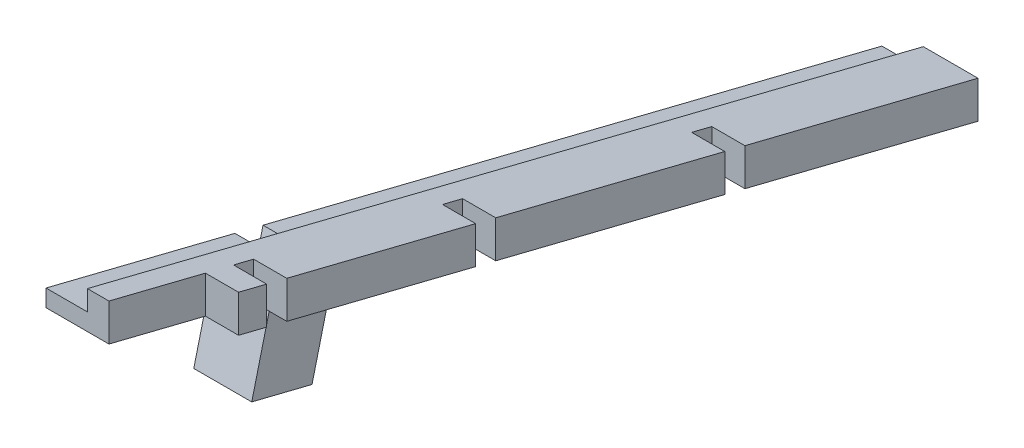
ISO-10303-21;
HEADER;
FILE_DESCRIPTION(('STEP AP214'),'2;1');
FILE_NAME('part.step','',(''),(''),'','','');
FILE_SCHEMA(('AUTOMOTIVE_DESIGN { 1 0 10303 214 1 1 1 1 }'));
ENDSEC;
DATA;
#1=APPLICATION_CONTEXT('core data for automotive mechanical design processes');
#2=APPLICATION_PROTOCOL_DEFINITION('international standard','automotive_design',2000,#1);
#3=PRODUCT_CONTEXT('',#1,'mechanical');
#4=PRODUCT('Part','Part','',(#3));
#5=PRODUCT_RELATED_PRODUCT_CATEGORY('part','',(#4));
#6=PRODUCT_DEFINITION_FORMATION('','',#4);
#7=PRODUCT_DEFINITION_CONTEXT('part definition',#1,'design');
#8=PRODUCT_DEFINITION('design','',#6,#7);
#9=PRODUCT_DEFINITION_SHAPE('','',#8);
#10=(LENGTH_UNIT() NAMED_UNIT(*) SI_UNIT(.MILLI.,.METRE.));
#11=(NAMED_UNIT(*) PLANE_ANGLE_UNIT() SI_UNIT($,.RADIAN.));
#12=(NAMED_UNIT(*) SI_UNIT($,.STERADIAN.) SOLID_ANGLE_UNIT());
#13=UNCERTAINTY_MEASURE_WITH_UNIT(LENGTH_MEASURE(1.E-05),#10,'distance_accuracy_value','');
#14=(GEOMETRIC_REPRESENTATION_CONTEXT(3) GLOBAL_UNCERTAINTY_ASSIGNED_CONTEXT((#13)) GLOBAL_UNIT_ASSIGNED_CONTEXT((#10,
#11,#12)) REPRESENTATION_CONTEXT('',''));
#15=CARTESIAN_POINT('',(0.,0.,0.));
#16=DIRECTION('',(0.,0.,1.));
#17=DIRECTION('',(1.,0.,0.));
#18=AXIS2_PLACEMENT_3D('',#15,#16,#17);
#19=CARTESIAN_POINT('',(4.,-4.23663208393258,1.05631101626826));
#20=DIRECTION('',(0.,0.970295726275996,-0.241921895599668));
#21=DIRECTION('',(0.,0.241921895599668,0.970295726275996));
#22=AXIS2_PLACEMENT_3D('',#19,#20,#21);
#23=PLANE('',#22);
#24=DIRECTION('',(1.,0.,0.));
#25=VECTOR('',#24,1.);
#26=CARTESIAN_POINT('',(-7.6,-8.49203641904656,-16.0111835554926));
#27=LINE('',#26,#25);
#28=CARTESIAN_POINT('',(-7.6,-8.49203641904656,-16.0111835554926));
#29=VERTEX_POINT('',#28);
#30=CARTESIAN_POINT('',(-0.6,-8.49203641904656,-16.0111835554926));
#31=VERTEX_POINT('',#30);
#32=EDGE_CURVE('E263',#29,#31,#27,.T.);
#33=ORIENTED_EDGE('',*,*,#32,.F.);
#34=DIRECTION('',(0.,0.241921895599668,0.970295726275996));
#35=VECTOR('',#34,1.);
#36=CARTESIAN_POINT('',(-7.6,-26.7568143951695,-89.2672068173917));
#37=LINE('',#36,#35);
#38=CARTESIAN_POINT('',(-7.6,-26.7568143951695,-89.2672068173917));
#39=VERTEX_POINT('',#38);
#40=EDGE_CURVE('E232',#39,#29,#37,.T.);
#41=ORIENTED_EDGE('',*,*,#40,.F.);
#42=DIRECTION('',(1.,0.,0.));
#43=VECTOR('',#42,1.);
#44=CARTESIAN_POINT('',(-2.6,-26.7568143951695,-89.2672068173917));
#45=LINE('',#44,#43);
#46=CARTESIAN_POINT('',(4.,-26.7568143951695,-89.2672068173917));
#47=VERTEX_POINT('',#46);
#48=EDGE_CURVE('E465',#39,#47,#45,.T.);
#49=ORIENTED_EDGE('',*,*,#48,.T.);
#50=DIRECTION('',(0.,-0.241921895599668,-0.970295726275996));
#51=VECTOR('',#50,1.);
#52=CARTESIAN_POINT('',(4.,-4.23663208393258,1.05631101626826));
#53=LINE('',#52,#51);
#54=CARTESIAN_POINT('',(4.,-19.7410794227791,-61.1286307553878));
#55=VERTEX_POINT('',#54);
#56=EDGE_CURVE('E341',#55,#47,#53,.T.);
#57=ORIENTED_EDGE('',*,*,#56,.F.);
#58=DIRECTION('',(-1.,0.,0.));
#59=VECTOR('',#58,1.);
#60=CARTESIAN_POINT('',(4.,-19.7410794227791,-61.1286307553878));
#61=LINE('',#60,#59);
#62=CARTESIAN_POINT('',(0.,-19.7410794227791,-61.1286307553878));
#63=VERTEX_POINT('',#62);
#64=EDGE_CURVE('E359',#55,#63,#61,.T.);
#65=ORIENTED_EDGE('',*,*,#64,.T.);
#66=DIRECTION('',(0.,0.241921895599668,0.970295726275996));
#67=VECTOR('',#66,1.);
#68=CARTESIAN_POINT('',(0.,-26.7568143951695,-89.2672068173917));
#69=LINE('',#68,#67);
#70=CARTESIAN_POINT('',(0.,-19.1362746837799,-58.7028914396978));
#71=VERTEX_POINT('',#70);
#72=EDGE_CURVE('E452',#63,#71,#69,.T.);
#73=ORIENTED_EDGE('',*,*,#72,.T.);
#74=DIRECTION('',(-1.,0.,0.));
#75=VECTOR('',#74,1.);
#76=CARTESIAN_POINT('',(4.,-19.1362746837799,-58.7028914396978));
#77=LINE('',#76,#75);
#78=CARTESIAN_POINT('',(4.,-19.1362746837799,-58.7028914396978));
#79=VERTEX_POINT('',#78);
#80=EDGE_CURVE('E390',#79,#71,#77,.T.);
#81=ORIENTED_EDGE('',*,*,#80,.F.);
#82=DIRECTION('',(0.,-0.241921895599668,-0.970295726275996));
#83=VECTOR('',#82,1.);
#84=CARTESIAN_POINT('',(4.,-4.23663208393258,1.05631101626826));
#85=LINE('',#84,#83);
#86=CARTESIAN_POINT('',(4.,-12.2415006591894,-31.0494632408319));
#87=VERTEX_POINT('',#86);
#88=EDGE_CURVE('E367',#87,#79,#85,.T.);
#89=ORIENTED_EDGE('',*,*,#88,.F.);
#90=DIRECTION('',(-1.,0.,0.));
#91=VECTOR('',#90,1.);
#92=CARTESIAN_POINT('',(4.,-12.2415006591894,-31.0494632408319));
#93=LINE('',#92,#91);
#94=CARTESIAN_POINT('',(0.,-12.2415006591894,-31.0494632408319));
#95=VERTEX_POINT('',#94);
#96=EDGE_CURVE('E394',#87,#95,#93,.T.);
#97=ORIENTED_EDGE('',*,*,#96,.T.);
#98=CARTESIAN_POINT('',(0.,-11.6366959201902,-28.6237239251419));
#99=VERTEX_POINT('',#98);
#100=EDGE_CURVE('E455',#95,#99,#69,.T.);
#101=ORIENTED_EDGE('',*,*,#100,.T.);
#102=DIRECTION('',(-1.,0.,0.));
#103=VECTOR('',#102,1.);
#104=CARTESIAN_POINT('',(4.,-11.6366959201902,-28.6237239251419));
#105=LINE('',#104,#103);
#106=CARTESIAN_POINT('',(4.,-11.6366959201902,-28.6237239251419));
#107=VERTEX_POINT('',#106);
#108=EDGE_CURVE('E425',#107,#99,#105,.T.);
#109=ORIENTED_EDGE('',*,*,#108,.F.);
#110=DIRECTION('',(0.,-0.241921895599668,-0.970295726275996));
#111=VECTOR('',#110,1.);
#112=CARTESIAN_POINT('',(4.,-4.23663208393258,1.05631101626826));
#113=LINE('',#112,#111);
#114=CARTESIAN_POINT('',(4.,-5.95153137359801,-5.82177435765599));
#115=VERTEX_POINT('',#114);
#116=EDGE_CURVE('E402',#115,#107,#113,.T.);
#117=ORIENTED_EDGE('',*,*,#116,.F.);
#118=DIRECTION('',(-1.,0.,0.));
#119=VECTOR('',#118,1.);
#120=CARTESIAN_POINT('',(4.,-5.95153137359801,-5.82177435765599));
#121=LINE('',#120,#119);
#122=CARTESIAN_POINT('',(0.,-5.95153137359801,-5.82177435765599));
#123=VERTEX_POINT('',#122);
#124=EDGE_CURVE('E429',#115,#123,#121,.T.);
#125=ORIENTED_EDGE('',*,*,#124,.T.);
#126=CARTESIAN_POINT('',(0.,-5.34672663459884,-3.39603504196599));
#127=VERTEX_POINT('',#126);
#128=EDGE_CURVE('E514',#123,#127,#69,.T.);
#129=ORIENTED_EDGE('',*,*,#128,.T.);
#130=DIRECTION('',(-1.,0.,0.));
#131=VECTOR('',#130,1.);
#132=CARTESIAN_POINT('',(4.,-5.34672663459884,-3.39603504196599));
#133=LINE('',#132,#131);
#134=CARTESIAN_POINT('',(4.,-5.34672663459884,-3.39603504196599));
#135=VERTEX_POINT('',#134);
#136=EDGE_CURVE('E11',#135,#127,#133,.T.);
#137=ORIENTED_EDGE('',*,*,#136,.F.);
#138=DIRECTION('',(0.,-0.241921895599668,-0.970295726275996));
#139=VECTOR('',#138,1.);
#140=CARTESIAN_POINT('',(4.,-4.23663208393258,1.05631101626826));
#141=LINE('',#140,#139);
#142=CARTESIAN_POINT('',(4.,-4.5,0.));
#143=VERTEX_POINT('',#142);
#144=EDGE_CURVE('E472',#143,#135,#141,.T.);
#145=ORIENTED_EDGE('',*,*,#144,.F.);
#146=DIRECTION('',(-1.,0.,0.));
#147=VECTOR('',#146,1.);
#148=CARTESIAN_POINT('',(4.,-4.5,0.));
#149=LINE('',#148,#147);
#150=CARTESIAN_POINT('',(0.,-4.5,0.));
#151=VERTEX_POINT('',#150);
#152=EDGE_CURVE('E487',#143,#151,#149,.T.);
#153=ORIENTED_EDGE('',*,*,#152,.T.);
#154=CARTESIAN_POINT('',(0.,-1.59693725280398,11.643548715312));
#155=VERTEX_POINT('',#154);
#156=EDGE_CURVE('E450',#151,#155,#69,.T.);
#157=ORIENTED_EDGE('',*,*,#156,.T.);
#158=DIRECTION('',(1.,0.,0.));
#159=VECTOR('',#158,1.);
#160=CARTESIAN_POINT('',(-2.6,-1.59693725280398,11.643548715312));
#161=LINE('',#160,#159);
#162=CARTESIAN_POINT('',(-7.6,-1.59693725280398,11.643548715312));
#163=VERTEX_POINT('',#162);
#164=EDGE_CURVE('E461',#163,#155,#161,.T.);
#165=ORIENTED_EDGE('',*,*,#164,.F.);
#166=CARTESIAN_POINT('',(-7.6,-6.67762220204905,-8.73396560842266));
#167=VERTEX_POINT('',#166);
#168=EDGE_CURVE('E315',#167,#163,#37,.T.);
#169=ORIENTED_EDGE('',*,*,#168,.F.);
#170=DIRECTION('',(-1.,0.,0.));
#171=VECTOR('',#170,1.);
#172=CARTESIAN_POINT('',(-0.6,-6.67762220204905,-8.73396560842266));
#173=LINE('',#172,#171);
#174=CARTESIAN_POINT('',(-0.6,-6.67762220204905,-8.73396560842266));
#175=VERTEX_POINT('',#174);
#176=EDGE_CURVE('E270',#175,#167,#173,.T.);
#177=ORIENTED_EDGE('',*,*,#176,.F.);
#178=DIRECTION('',(0.,0.241921895599668,0.970295726275996));
#179=VECTOR('',#178,1.);
#180=CARTESIAN_POINT('',(-0.6,-6.67762220204905,-8.73396560842266));
#181=LINE('',#180,#179);
#182=EDGE_CURVE('E281',#31,#175,#181,.T.);
#183=ORIENTED_EDGE('',*,*,#182,.F.);
#184=EDGE_LOOP('',(#33,#41,#49,#57,#65,#73,#81,#89,#97,#101,#109,#117,#125,#129,#137,#145,#153,
#157,#165,#169,#177,#183));
#185=FACE_BOUND('',#184,.T.);
#186=ADVANCED_FACE('F39',(#185),#23,.F.);
#187=CARTESIAN_POINT('',(-7.6,-24.6955871364697,-89.2672068173917));
#188=DIRECTION('',(0.,-0.970295726275996,0.241921895599668));
#189=DIRECTION('',(0.,-0.241921895599668,-0.970295726275996));
#190=AXIS2_PLACEMENT_3D('',#187,#188,#189);
#191=PLANE('',#190);
#192=DIRECTION('',(0.,-0.241921895599668,-0.970295726275996));
#193=VECTOR('',#192,1.);
#194=CARTESIAN_POINT('',(-2.6,-24.6955871364697,-89.2672068173917));
#195=LINE('',#194,#193);
#196=CARTESIAN_POINT('',(-2.6,0.464290005895813,11.643548715312));
#197=VERTEX_POINT('',#196);
#198=CARTESIAN_POINT('',(-2.6,-5.2208745406964,-11.158400852174));
#199=VERTEX_POINT('',#198);
#200=EDGE_CURVE('E62',#197,#199,#195,.T.);
#201=ORIENTED_EDGE('',*,*,#200,.T.);
#202=DIRECTION('',(-1.,0.,0.));
#203=VECTOR('',#202,1.);
#204=CARTESIAN_POINT('',(-2.6,-5.2208745406964,-11.158400852174));
#205=LINE('',#204,#203);
#206=CARTESIAN_POINT('',(-7.6,-5.2208745406964,-11.158400852174));
#207=VERTEX_POINT('',#206);
#208=EDGE_CURVE('E236',#199,#207,#205,.T.);
#209=ORIENTED_EDGE('',*,*,#208,.T.);
#210=DIRECTION('',(0.,-0.241921895599668,-0.970295726275996));
#211=VECTOR('',#210,1.);
#212=CARTESIAN_POINT('',(-7.6,-24.6955871364697,-89.2672068173917));
#213=LINE('',#212,#211);
#214=CARTESIAN_POINT('',(-7.6,0.464290005895813,11.643548715312));
#215=VERTEX_POINT('',#214);
#216=EDGE_CURVE('E322',#215,#207,#213,.T.);
#217=ORIENTED_EDGE('',*,*,#216,.F.);
#218=DIRECTION('',(1.,0.,0.));
#219=VECTOR('',#218,1.);
#220=CARTESIAN_POINT('',(-7.6,0.464290005895813,11.643548715312));
#221=LINE('',#220,#219);
#222=EDGE_CURVE('E332',#215,#197,#221,.T.);
#223=ORIENTED_EDGE('',*,*,#222,.T.);
#224=EDGE_LOOP('',(#201,#209,#217,#223));
#225=FACE_BOUND('',#224,.T.);
#226=ADVANCED_FACE('F573',(#225),#191,.F.);
#227=CARTESIAN_POINT('',(-2.6,0.,0.));
#228=DIRECTION('',(1.,0.,0.));
#229=DIRECTION('',(0.,0.,-1.));
#230=AXIS2_PLACEMENT_3D('',#227,#228,#229);
#231=PLANE('',#230);
#232=ORIENTED_EDGE('',*,*,#200,.F.);
#233=DIRECTION('',(0.,1.,0.));
#234=VECTOR('',#233,1.);
#235=CARTESIAN_POINT('',(-2.6,2.90306274719602,11.643548715312));
#236=LINE('',#235,#234);
#237=CARTESIAN_POINT('',(-2.6,2.90306274719602,11.643548715312));
#238=VERTEX_POINT('',#237);
#239=EDGE_CURVE('E442',#197,#238,#236,.T.);
#240=ORIENTED_EDGE('',*,*,#239,.T.);
#241=DIRECTION('',(0.,-0.241921895599668,-0.970295726275996));
#242=VECTOR('',#241,1.);
#243=CARTESIAN_POINT('',(-2.6,-22.2568143951695,-89.2672068173917));
#244=LINE('',#243,#242);
#245=CARTESIAN_POINT('',(-2.6,-22.2568143951695,-89.2672068173917));
#246=VERTEX_POINT('',#245);
#247=EDGE_CURVE('E433',#238,#246,#244,.T.);
#248=ORIENTED_EDGE('',*,*,#247,.T.);
#249=DIRECTION('',(0.,-1.,0.));
#250=VECTOR('',#249,1.);
#251=CARTESIAN_POINT('',(-2.6,-22.2568143951695,-89.2672068173917));
#252=LINE('',#251,#250);
#253=CARTESIAN_POINT('',(-2.6,-24.6955871364697,-89.2672068173917));
#254=VERTEX_POINT('',#253);
#255=EDGE_CURVE('E437',#246,#254,#252,.T.);
#256=ORIENTED_EDGE('',*,*,#255,.T.);
#257=CARTESIAN_POINT('',(-2.6,-6.06760117529524,-14.55443589414));
#258=VERTEX_POINT('',#257);
#259=EDGE_CURVE('E303',#258,#254,#195,.T.);
#260=ORIENTED_EDGE('',*,*,#259,.F.);
#261=DIRECTION('',(0.,-0.970295726275996,0.241921895599668));
#262=VECTOR('',#261,1.);
#263=CARTESIAN_POINT('',(-2.6,-6.06760117529524,-14.55443589414));
#264=LINE('',#263,#262);
#265=CARTESIAN_POINT('',(-2.6,-16.2557063011932,-12.0142559903435));
#266=VERTEX_POINT('',#265);
#267=EDGE_CURVE('E304',#258,#266,#264,.T.);
#268=ORIENTED_EDGE('',*,*,#267,.T.);
#269=DIRECTION('',(0.,-0.241921895599668,-0.970295726275996));
#270=VECTOR('',#269,1.);
#271=CARTESIAN_POINT('',(-2.6,-16.2557063011932,-12.0142559903435));
#272=LINE('',#271,#270);
#273=CARTESIAN_POINT('',(-2.6,-15.4089796665944,-8.61822094837747));
#274=VERTEX_POINT('',#273);
#275=EDGE_CURVE('E265',#274,#266,#272,.T.);
#276=ORIENTED_EDGE('',*,*,#275,.F.);
#277=DIRECTION('',(0.,-0.970295726275996,0.241921895599668));
#278=VECTOR('',#277,1.);
#279=CARTESIAN_POINT('',(-2.6,-5.2208745406964,-11.158400852174));
#280=LINE('',#279,#278);
#281=EDGE_CURVE('E300',#199,#274,#280,.T.);
#282=ORIENTED_EDGE('',*,*,#281,.F.);
#283=EDGE_LOOP('',(#232,#240,#248,#256,#260,#268,#276,#282));
#284=FACE_BOUND('',#283,.T.);
#285=ADVANCED_FACE('F545',(#284),#231,.F.);
#286=CARTESIAN_POINT('',(0.,0.,0.));
#287=DIRECTION('',(1.,0.,0.));
#288=DIRECTION('',(0.,0.,-1.));
#289=AXIS2_PLACEMENT_3D('',#286,#287,#288);
#290=PLANE('',#289);
#291=DIRECTION('',(0.,1.,0.));
#292=VECTOR('',#291,1.);
#293=CARTESIAN_POINT('',(0.,0.,-61.1286307553878));
#294=LINE('',#293,#292);
#295=CARTESIAN_POINT('',(0.,-15.2410794227791,-61.1286307553878));
#296=VERTEX_POINT('',#295);
#297=EDGE_CURVE('E336',#63,#296,#294,.T.);
#298=ORIENTED_EDGE('',*,*,#297,.T.);
#299=DIRECTION('',(0.,-0.241921895599668,-0.970295726275996));
#300=VECTOR('',#299,1.);
#301=CARTESIAN_POINT('',(0.,-22.2568143951695,-89.2672068173917));
#302=LINE('',#301,#300);
#303=CARTESIAN_POINT('',(0.,-14.6362746837799,-58.7028914396978));
#304=VERTEX_POINT('',#303);
#305=EDGE_CURVE('E432',#304,#296,#302,.T.);
#306=ORIENTED_EDGE('',*,*,#305,.F.);
#307=DIRECTION('',(0.,1.,0.));
#308=VECTOR('',#307,1.);
#309=CARTESIAN_POINT('',(0.,0.,-58.7028914396978));
#310=LINE('',#309,#308);
#311=EDGE_CURVE('E368',#71,#304,#310,.T.);
#312=ORIENTED_EDGE('',*,*,#311,.F.);
#313=ORIENTED_EDGE('',*,*,#72,.F.);
#314=EDGE_LOOP('',(#298,#306,#312,#313));
#315=FACE_BOUND('',#314,.T.);
#316=ADVANCED_FACE('F527',(#315),#290,.T.);
#317=DIRECTION('',(0.,1.,0.));
#318=VECTOR('',#317,1.);
#319=CARTESIAN_POINT('',(0.,0.,-31.0494632408319));
#320=LINE('',#319,#318);
#321=CARTESIAN_POINT('',(0.,-7.74150065918938,-31.0494632408319));
#322=VERTEX_POINT('',#321);
#323=EDGE_CURVE('E362',#95,#322,#320,.T.);
#324=ORIENTED_EDGE('',*,*,#323,.T.);
#325=CARTESIAN_POINT('',(0.,-7.13669592019021,-28.6237239251419));
#326=VERTEX_POINT('',#325);
#327=EDGE_CURVE('E517',#326,#322,#302,.T.);
#328=ORIENTED_EDGE('',*,*,#327,.F.);
#329=DIRECTION('',(0.,1.,0.));
#330=VECTOR('',#329,1.);
#331=CARTESIAN_POINT('',(0.,0.,-28.6237239251419));
#332=LINE('',#331,#330);
#333=EDGE_CURVE('E403',#99,#326,#332,.T.);
#334=ORIENTED_EDGE('',*,*,#333,.F.);
#335=ORIENTED_EDGE('',*,*,#100,.F.);
#336=EDGE_LOOP('',(#324,#328,#334,#335));
#337=FACE_BOUND('',#336,.T.);
#338=ADVANCED_FACE('F809',(#337),#290,.T.);
#339=CARTESIAN_POINT('',(4.,0.,-3.39603504196599));
#340=DIRECTION('',(0.,0.,1.));
#341=DIRECTION('',(1.,0.,0.));
#342=AXIS2_PLACEMENT_3D('',#339,#340,#341);
#343=PLANE('',#342);
#344=DIRECTION('',(0.,1.,0.));
#345=VECTOR('',#344,1.);
#346=CARTESIAN_POINT('',(0.,0.,-3.39603504196599));
#347=LINE('',#346,#345);
#348=CARTESIAN_POINT('',(0.,-0.84672663459884,-3.39603504196599));
#349=VERTEX_POINT('',#348);
#350=EDGE_CURVE('E471',#127,#349,#347,.T.);
#351=ORIENTED_EDGE('',*,*,#350,.T.);
#352=DIRECTION('',(-1.,0.,0.));
#353=VECTOR('',#352,1.);
#354=CARTESIAN_POINT('',(4.,-0.84672663459884,-3.39603504196599));
#355=LINE('',#354,#353);
#356=CARTESIAN_POINT('',(4.,-0.84672663459884,-3.39603504196599));
#357=VERTEX_POINT('',#356);
#358=EDGE_CURVE('E47',#357,#349,#355,.T.);
#359=ORIENTED_EDGE('',*,*,#358,.F.);
#360=DIRECTION('',(0.,1.,0.));
#361=VECTOR('',#360,1.);
#362=CARTESIAN_POINT('',(4.,0.,-3.39603504196599));
#363=LINE('',#362,#361);
#364=EDGE_CURVE('E476',#135,#357,#363,.T.);
#365=ORIENTED_EDGE('',*,*,#364,.F.);
#366=ORIENTED_EDGE('',*,*,#136,.T.);
#367=EDGE_LOOP('',(#351,#359,#365,#366));
#368=FACE_BOUND('',#367,.T.);
#369=ADVANCED_FACE('F509',(#368),#343,.F.);
#370=CARTESIAN_POINT('',(4.,0.,0.));
#371=DIRECTION('',(0.,0.970295726275996,-0.241921895599668));
#372=DIRECTION('',(0.,0.241921895599668,0.970295726275996));
#373=AXIS2_PLACEMENT_3D('',#370,#371,#372);
#374=PLANE('',#373);
#375=ORIENTED_EDGE('',*,*,#358,.T.);
#376=CARTESIAN_POINT('',(0.,-1.45153137359801,-5.82177435765598));
#377=VERTEX_POINT('',#376);
#378=EDGE_CURVE('E451',#349,#377,#302,.T.);
#379=ORIENTED_EDGE('',*,*,#378,.T.);
#380=DIRECTION('',(-1.,0.,0.));
#381=VECTOR('',#380,1.);
#382=CARTESIAN_POINT('',(4.,-1.45153137359801,-5.82177435765598));
#383=LINE('',#382,#381);
#384=CARTESIAN_POINT('',(4.,-1.45153137359801,-5.82177435765598));
#385=VERTEX_POINT('',#384);
#386=EDGE_CURVE('E413',#385,#377,#383,.T.);
#387=ORIENTED_EDGE('',*,*,#386,.F.);
#388=DIRECTION('',(0.,-0.241921895599668,-0.970295726275996));
#389=VECTOR('',#388,1.);
#390=CARTESIAN_POINT('',(4.,0.,0.));
#391=LINE('',#390,#389);
#392=CARTESIAN_POINT('',(4.,-7.13669592019021,-28.6237239251419));
#393=VERTEX_POINT('',#392);
#394=EDGE_CURVE('E409',#385,#393,#391,.T.);
#395=ORIENTED_EDGE('',*,*,#394,.T.);
#396=DIRECTION('',(-1.,0.,0.));
#397=VECTOR('',#396,1.);
#398=CARTESIAN_POINT('',(4.,-7.13669592019021,-28.6237239251419));
#399=LINE('',#398,#397);
#400=EDGE_CURVE('E421',#393,#326,#399,.T.);
#401=ORIENTED_EDGE('',*,*,#400,.T.);
#402=ORIENTED_EDGE('',*,*,#327,.T.);
#403=DIRECTION('',(-1.,0.,0.));
#404=VECTOR('',#403,1.);
#405=CARTESIAN_POINT('',(4.,-7.74150065918938,-31.0494632408319));
#406=LINE('',#405,#404);
#407=CARTESIAN_POINT('',(4.,-7.74150065918938,-31.0494632408319));
#408=VERTEX_POINT('',#407);
#409=EDGE_CURVE('E378',#408,#322,#406,.T.);
#410=ORIENTED_EDGE('',*,*,#409,.F.);
#411=DIRECTION('',(0.,-0.241921895599668,-0.970295726275996));
#412=VECTOR('',#411,1.);
#413=CARTESIAN_POINT('',(4.,0.,0.));
#414=LINE('',#413,#412);
#415=CARTESIAN_POINT('',(4.,-14.6362746837799,-58.7028914396978));
#416=VERTEX_POINT('',#415);
#417=EDGE_CURVE('E374',#408,#416,#414,.T.);
#418=ORIENTED_EDGE('',*,*,#417,.T.);
#419=DIRECTION('',(-1.,0.,0.));
#420=VECTOR('',#419,1.);
#421=CARTESIAN_POINT('',(4.,-14.6362746837799,-58.7028914396978));
#422=LINE('',#421,#420);
#423=EDGE_CURVE('E386',#416,#304,#422,.T.);
#424=ORIENTED_EDGE('',*,*,#423,.T.);
#425=ORIENTED_EDGE('',*,*,#305,.T.);
#426=DIRECTION('',(-1.,0.,0.));
#427=VECTOR('',#426,1.);
#428=CARTESIAN_POINT('',(4.,-15.2410794227791,-61.1286307553878));
#429=LINE('',#428,#427);
#430=CARTESIAN_POINT('',(4.,-15.2410794227791,-61.1286307553878));
#431=VERTEX_POINT('',#430);
#432=EDGE_CURVE('E353',#431,#296,#429,.T.);
#433=ORIENTED_EDGE('',*,*,#432,.F.);
#434=DIRECTION('',(0.,-0.241921895599668,-0.970295726275996));
#435=VECTOR('',#434,1.);
#436=CARTESIAN_POINT('',(4.,0.,0.));
#437=LINE('',#436,#435);
#438=CARTESIAN_POINT('',(4.,-22.2568143951695,-89.2672068173917));
#439=VERTEX_POINT('',#438);
#440=EDGE_CURVE('E349',#431,#439,#437,.T.);
#441=ORIENTED_EDGE('',*,*,#440,.T.);
#442=DIRECTION('',(1.,0.,0.));
#443=VECTOR('',#442,1.);
#444=CARTESIAN_POINT('',(-2.6,-22.2568143951695,-89.2672068173917));
#445=LINE('',#444,#443);
#446=EDGE_CURVE('E468',#246,#439,#445,.T.);
#447=ORIENTED_EDGE('',*,*,#446,.F.);
#448=ORIENTED_EDGE('',*,*,#247,.F.);
#449=DIRECTION('',(1.,0.,0.));
#450=VECTOR('',#449,1.);
#451=CARTESIAN_POINT('',(-2.6,2.90306274719602,11.643548715312));
#452=LINE('',#451,#450);
#453=CARTESIAN_POINT('',(0.,2.90306274719602,11.643548715312));
#454=VERTEX_POINT('',#453);
#455=EDGE_CURVE('E445',#238,#454,#452,.T.);
#456=ORIENTED_EDGE('',*,*,#455,.T.);
#457=CARTESIAN_POINT('',(0.,0.,0.));
#458=VERTEX_POINT('',#457);
#459=EDGE_CURVE('E446',#454,#458,#302,.T.);
#460=ORIENTED_EDGE('',*,*,#459,.T.);
#461=DIRECTION('',(-1.,0.,0.));
#462=VECTOR('',#461,1.);
#463=CARTESIAN_POINT('',(4.,0.,0.));
#464=LINE('',#463,#462);
#465=CARTESIAN_POINT('',(4.,0.,0.));
#466=VERTEX_POINT('',#465);
#467=EDGE_CURVE('E497',#466,#458,#464,.T.);
#468=ORIENTED_EDGE('',*,*,#467,.F.);
#469=DIRECTION('',(0.,-0.241921895599668,-0.970295726275996));
#470=VECTOR('',#469,1.);
#471=CARTESIAN_POINT('',(4.,0.,0.));
#472=LINE('',#471,#470);
#473=EDGE_CURVE('E480',#466,#357,#472,.T.);
#474=ORIENTED_EDGE('',*,*,#473,.T.);
#475=EDGE_LOOP('',(#375,#379,#387,#395,#401,#402,#410,#418,#424,#425,#433,#441,#447,#448,#456,
#460,#468,#474));
#476=FACE_BOUND('',#475,.T.);
#477=ADVANCED_FACE('F505',(#476),#374,.T.);
#478=CARTESIAN_POINT('',(4.,0.,0.));
#479=DIRECTION('',(0.,0.,-1.));
#480=DIRECTION('',(-1.,0.,0.));
#481=AXIS2_PLACEMENT_3D('',#478,#479,#480);
#482=PLANE('',#481);
#483=DIRECTION('',(0.,-1.,0.));
#484=VECTOR('',#483,1.);
#485=CARTESIAN_POINT('',(0.,0.,0.));
#486=LINE('',#485,#484);
#487=EDGE_CURVE('E477',#458,#151,#486,.T.);
#488=ORIENTED_EDGE('',*,*,#487,.T.);
#489=ORIENTED_EDGE('',*,*,#152,.F.);
#490=DIRECTION('',(0.,-1.,0.));
#491=VECTOR('',#490,1.);
#492=CARTESIAN_POINT('',(4.,0.,0.));
#493=LINE('',#492,#491);
#494=EDGE_CURVE('E484',#466,#143,#493,.T.);
#495=ORIENTED_EDGE('',*,*,#494,.F.);
#496=ORIENTED_EDGE('',*,*,#467,.T.);
#497=EDGE_LOOP('',(#488,#489,#495,#496));
#498=FACE_BOUND('',#497,.T.);
#499=ADVANCED_FACE('F556',(#498),#482,.F.);
#500=CARTESIAN_POINT('',(4.,0.,0.));
#501=DIRECTION('',(1.,0.,0.));
#502=DIRECTION('',(0.,0.,-1.));
#503=AXIS2_PLACEMENT_3D('',#500,#501,#502);
#504=PLANE('',#503);
#505=ORIENTED_EDGE('',*,*,#144,.T.);
#506=ORIENTED_EDGE('',*,*,#364,.T.);
#507=ORIENTED_EDGE('',*,*,#473,.F.);
#508=ORIENTED_EDGE('',*,*,#494,.T.);
#509=EDGE_LOOP('',(#505,#506,#507,#508));
#510=FACE_BOUND('',#509,.T.);
#511=ADVANCED_FACE('F562',(#510),#504,.T.);
#512=ORIENTED_EDGE('',*,*,#487,.F.);
#513=ORIENTED_EDGE('',*,*,#459,.F.);
#514=DIRECTION('',(0.,1.,0.));
#515=VECTOR('',#514,1.);
#516=CARTESIAN_POINT('',(0.,2.90306274719602,11.643548715312));
#517=LINE('',#516,#515);
#518=EDGE_CURVE('E438',#155,#454,#517,.T.);
#519=ORIENTED_EDGE('',*,*,#518,.F.);
#520=ORIENTED_EDGE('',*,*,#156,.F.);
#521=EDGE_LOOP('',(#512,#513,#519,#520));
#522=FACE_BOUND('',#521,.T.);
#523=ADVANCED_FACE('F553',(#522),#290,.T.);
#524=DIRECTION('',(0.,1.,0.));
#525=VECTOR('',#524,1.);
#526=CARTESIAN_POINT('',(0.,0.,-5.82177435765597));
#527=LINE('',#526,#525);
#528=EDGE_CURVE('E397',#123,#377,#527,.T.);
#529=ORIENTED_EDGE('',*,*,#528,.T.);
#530=ORIENTED_EDGE('',*,*,#378,.F.);
#531=ORIENTED_EDGE('',*,*,#350,.F.);
#532=ORIENTED_EDGE('',*,*,#128,.F.);
#533=EDGE_LOOP('',(#529,#530,#531,#532));
#534=FACE_BOUND('',#533,.T.);
#535=ADVANCED_FACE('F513',(#534),#290,.T.);
#536=CARTESIAN_POINT('',(-2.6,-22.2568143951695,-89.2672068173917));
#537=DIRECTION('',(0.,0.,1.));
#538=DIRECTION('',(1.,0.,0.));
#539=AXIS2_PLACEMENT_3D('',#536,#537,#538);
#540=PLANE('',#539);
#541=ORIENTED_EDGE('',*,*,#446,.T.);
#542=DIRECTION('',(0.,1.,0.));
#543=VECTOR('',#542,1.);
#544=CARTESIAN_POINT('',(4.,0.,-89.2672068173917));
#545=LINE('',#544,#543);
#546=EDGE_CURVE('E345',#47,#439,#545,.T.);
#547=ORIENTED_EDGE('',*,*,#546,.F.);
#548=ORIENTED_EDGE('',*,*,#48,.F.);
#549=DIRECTION('',(0.,-1.,0.));
#550=VECTOR('',#549,1.);
#551=CARTESIAN_POINT('',(-7.6,-24.6955871364697,-89.2672068173917));
#552=LINE('',#551,#550);
#553=CARTESIAN_POINT('',(-7.6,-24.6955871364697,-89.2672068173917));
#554=VERTEX_POINT('',#553);
#555=EDGE_CURVE('E312',#554,#39,#552,.T.);
#556=ORIENTED_EDGE('',*,*,#555,.F.);
#557=DIRECTION('',(1.,0.,0.));
#558=VECTOR('',#557,1.);
#559=CARTESIAN_POINT('',(-7.6,-24.6955871364697,-89.2672068173917));
#560=LINE('',#559,#558);
#561=EDGE_CURVE('E326',#554,#254,#560,.T.);
#562=ORIENTED_EDGE('',*,*,#561,.T.);
#563=ORIENTED_EDGE('',*,*,#255,.F.);
#564=EDGE_LOOP('',(#541,#547,#548,#556,#562,#563));
#565=FACE_BOUND('',#564,.T.);
#566=ADVANCED_FACE('F541',(#565),#540,.F.);
#567=CARTESIAN_POINT('',(-2.6,2.90306274719602,11.643548715312));
#568=DIRECTION('',(0.,0.,-1.));
#569=DIRECTION('',(0.,1.,0.));
#570=AXIS2_PLACEMENT_3D('',#567,#568,#569);
#571=PLANE('',#570);
#572=ORIENTED_EDGE('',*,*,#518,.T.);
#573=ORIENTED_EDGE('',*,*,#455,.F.);
#574=ORIENTED_EDGE('',*,*,#239,.F.);
#575=ORIENTED_EDGE('',*,*,#222,.F.);
#576=DIRECTION('',(0.,1.,0.));
#577=VECTOR('',#576,1.);
#578=CARTESIAN_POINT('',(-7.6,-1.59693725280398,11.643548715312));
#579=LINE('',#578,#577);
#580=EDGE_CURVE('E318',#163,#215,#579,.T.);
#581=ORIENTED_EDGE('',*,*,#580,.F.);
#582=ORIENTED_EDGE('',*,*,#164,.T.);
#583=EDGE_LOOP('',(#572,#573,#574,#575,#581,#582));
#584=FACE_BOUND('',#583,.T.);
#585=ADVANCED_FACE('F549',(#584),#571,.F.);
#586=CARTESIAN_POINT('',(4.,0.,-5.82177435765597));
#587=DIRECTION('',(0.,0.,1.));
#588=DIRECTION('',(0.,-1.,0.));
#589=AXIS2_PLACEMENT_3D('',#586,#587,#588);
#590=PLANE('',#589);
#591=ORIENTED_EDGE('',*,*,#528,.F.);
#592=ORIENTED_EDGE('',*,*,#124,.F.);
#593=DIRECTION('',(0.,1.,0.));
#594=VECTOR('',#593,1.);
#595=CARTESIAN_POINT('',(4.,0.,-5.82177435765597));
#596=LINE('',#595,#594);
#597=EDGE_CURVE('E398',#115,#385,#596,.T.);
#598=ORIENTED_EDGE('',*,*,#597,.T.);
#599=ORIENTED_EDGE('',*,*,#386,.T.);
#600=EDGE_LOOP('',(#591,#592,#598,#599));
#601=FACE_BOUND('',#600,.T.);
#602=ADVANCED_FACE('F713',(#601),#590,.T.);
#603=CARTESIAN_POINT('',(4.,0.,-28.6237239251419));
#604=DIRECTION('',(0.,0.,1.));
#605=DIRECTION('',(0.,-1.,0.));
#606=AXIS2_PLACEMENT_3D('',#603,#604,#605);
#607=PLANE('',#606);
#608=ORIENTED_EDGE('',*,*,#333,.T.);
#609=ORIENTED_EDGE('',*,*,#400,.F.);
#610=DIRECTION('',(0.,1.,0.));
#611=VECTOR('',#610,1.);
#612=CARTESIAN_POINT('',(4.,0.,-28.6237239251419));
#613=LINE('',#612,#611);
#614=EDGE_CURVE('E406',#107,#393,#613,.T.);
#615=ORIENTED_EDGE('',*,*,#614,.F.);
#616=ORIENTED_EDGE('',*,*,#108,.T.);
#617=EDGE_LOOP('',(#608,#609,#615,#616));
#618=FACE_BOUND('',#617,.T.);
#619=ADVANCED_FACE('F782',(#618),#607,.F.);
#620=CARTESIAN_POINT('',(4.,0.,0.));
#621=DIRECTION('',(1.,0.,0.));
#622=DIRECTION('',(0.,0.,-1.));
#623=AXIS2_PLACEMENT_3D('',#620,#621,#622);
#624=PLANE('',#623);
#625=ORIENTED_EDGE('',*,*,#597,.F.);
#626=ORIENTED_EDGE('',*,*,#116,.T.);
#627=ORIENTED_EDGE('',*,*,#614,.T.);
#628=ORIENTED_EDGE('',*,*,#394,.F.);
#629=EDGE_LOOP('',(#625,#626,#627,#628));
#630=FACE_BOUND('',#629,.T.);
#631=ADVANCED_FACE('F771',(#630),#624,.T.);
#632=CARTESIAN_POINT('',(4.,0.,-31.0494632408319));
#633=DIRECTION('',(0.,0.,1.));
#634=DIRECTION('',(0.,-1.,0.));
#635=AXIS2_PLACEMENT_3D('',#632,#633,#634);
#636=PLANE('',#635);
#637=ORIENTED_EDGE('',*,*,#323,.F.);
#638=ORIENTED_EDGE('',*,*,#96,.F.);
#639=DIRECTION('',(0.,1.,0.));
#640=VECTOR('',#639,1.);
#641=CARTESIAN_POINT('',(4.,0.,-31.0494632408319));
#642=LINE('',#641,#640);
#643=EDGE_CURVE('E363',#87,#408,#642,.T.);
#644=ORIENTED_EDGE('',*,*,#643,.T.);
#645=ORIENTED_EDGE('',*,*,#409,.T.);
#646=EDGE_LOOP('',(#637,#638,#644,#645));
#647=FACE_BOUND('',#646,.T.);
#648=ADVANCED_FACE('F761',(#647),#636,.T.);
#649=CARTESIAN_POINT('',(4.,0.,-58.7028914396978));
#650=DIRECTION('',(0.,0.,1.));
#651=DIRECTION('',(1.,0.,0.));
#652=AXIS2_PLACEMENT_3D('',#649,#650,#651);
#653=PLANE('',#652);
#654=ORIENTED_EDGE('',*,*,#311,.T.);
#655=ORIENTED_EDGE('',*,*,#423,.F.);
#656=DIRECTION('',(0.,1.,0.));
#657=VECTOR('',#656,1.);
#658=CARTESIAN_POINT('',(4.,0.,-58.7028914396978));
#659=LINE('',#658,#657);
#660=EDGE_CURVE('E371',#79,#416,#659,.T.);
#661=ORIENTED_EDGE('',*,*,#660,.F.);
#662=ORIENTED_EDGE('',*,*,#80,.T.);
#663=EDGE_LOOP('',(#654,#655,#661,#662));
#664=FACE_BOUND('',#663,.T.);
#665=ADVANCED_FACE('F751',(#664),#653,.F.);
#666=CARTESIAN_POINT('',(4.,0.,0.));
#667=DIRECTION('',(1.,0.,0.));
#668=DIRECTION('',(0.,0.,-1.));
#669=AXIS2_PLACEMENT_3D('',#666,#667,#668);
#670=PLANE('',#669);
#671=ORIENTED_EDGE('',*,*,#643,.F.);
#672=ORIENTED_EDGE('',*,*,#88,.T.);
#673=ORIENTED_EDGE('',*,*,#660,.T.);
#674=ORIENTED_EDGE('',*,*,#417,.F.);
#675=EDGE_LOOP('',(#671,#672,#673,#674));
#676=FACE_BOUND('',#675,.T.);
#677=ADVANCED_FACE('F741',(#676),#670,.T.);
#678=CARTESIAN_POINT('',(4.,0.,-61.1286307553878));
#679=DIRECTION('',(0.,0.,1.));
#680=DIRECTION('',(1.,0.,0.));
#681=AXIS2_PLACEMENT_3D('',#678,#679,#680);
#682=PLANE('',#681);
#683=ORIENTED_EDGE('',*,*,#297,.F.);
#684=ORIENTED_EDGE('',*,*,#64,.F.);
#685=DIRECTION('',(0.,1.,0.));
#686=VECTOR('',#685,1.);
#687=CARTESIAN_POINT('',(4.,0.,-61.1286307553878));
#688=LINE('',#687,#686);
#689=EDGE_CURVE('E337',#55,#431,#688,.T.);
#690=ORIENTED_EDGE('',*,*,#689,.T.);
#691=ORIENTED_EDGE('',*,*,#432,.T.);
#692=EDGE_LOOP('',(#683,#684,#690,#691));
#693=FACE_BOUND('',#692,.T.);
#694=ADVANCED_FACE('F531',(#693),#682,.T.);
#695=CARTESIAN_POINT('',(4.,0.,0.));
#696=DIRECTION('',(1.,0.,0.));
#697=DIRECTION('',(0.,0.,-1.));
#698=AXIS2_PLACEMENT_3D('',#695,#696,#697);
#699=PLANE('',#698);
#700=ORIENTED_EDGE('',*,*,#689,.F.);
#701=ORIENTED_EDGE('',*,*,#56,.T.);
#702=ORIENTED_EDGE('',*,*,#546,.T.);
#703=ORIENTED_EDGE('',*,*,#440,.F.);
#704=EDGE_LOOP('',(#700,#701,#702,#703));
#705=FACE_BOUND('',#704,.T.);
#706=ADVANCED_FACE('F536',(#705),#699,.T.);
#707=CARTESIAN_POINT('',(-7.6,-6.06760117529523,-14.55443589414));
#708=VERTEX_POINT('',#707);
#709=EDGE_CURVE('E321',#708,#554,#213,.T.);
#710=ORIENTED_EDGE('',*,*,#709,.F.);
#711=DIRECTION('',(1.,0.,0.));
#712=VECTOR('',#711,1.);
#713=CARTESIAN_POINT('',(-7.6,-6.06760117529524,-14.55443589414));
#714=LINE('',#713,#712);
#715=EDGE_CURVE('E54',#708,#258,#714,.T.);
#716=ORIENTED_EDGE('',*,*,#715,.T.);
#717=ORIENTED_EDGE('',*,*,#259,.T.);
#718=ORIENTED_EDGE('',*,*,#561,.F.);
#719=EDGE_LOOP('',(#710,#716,#717,#718));
#720=FACE_BOUND('',#719,.T.);
#721=ADVANCED_FACE('F579',(#720),#191,.F.);
#722=CARTESIAN_POINT('',(-7.6,0.,0.));
#723=DIRECTION('',(-1.,0.,0.));
#724=DIRECTION('',(0.,0.,1.));
#725=AXIS2_PLACEMENT_3D('',#722,#723,#724);
#726=PLANE('',#725);
#727=DIRECTION('',(0.,-0.970295726275996,0.241921895599668));
#728=VECTOR('',#727,1.);
#729=CARTESIAN_POINT('',(-7.6,-6.06760117529524,-14.55443589414));
#730=LINE('',#729,#728);
#731=CARTESIAN_POINT('',(-7.6,-16.2557063011932,-12.0142559903435));
#732=VERTEX_POINT('',#731);
#733=EDGE_CURVE('E307',#708,#732,#730,.T.);
#734=ORIENTED_EDGE('',*,*,#733,.F.);
#735=ORIENTED_EDGE('',*,*,#709,.T.);
#736=ORIENTED_EDGE('',*,*,#555,.T.);
#737=ORIENTED_EDGE('',*,*,#40,.T.);
#738=DIRECTION('',(0.,0.970295726275996,-0.241921895599668));
#739=VECTOR('',#738,1.);
#740=CARTESIAN_POINT('',(-7.6,-16.7395500923925,-13.9548474428954));
#741=LINE('',#740,#739);
#742=CARTESIAN_POINT('',(-7.6,-18.6801415449445,-13.4710036516961));
#743=VERTEX_POINT('',#742);
#744=EDGE_CURVE('E224',#743,#29,#741,.T.);
#745=ORIENTED_EDGE('',*,*,#744,.F.);
#746=DIRECTION('',(0.,-0.241921895599669,-0.970295726275996));
#747=VECTOR('',#746,1.);
#748=CARTESIAN_POINT('',(-7.6,-16.865727327947,-6.19378570462615));
#749=LINE('',#748,#747);
#750=CARTESIAN_POINT('',(-7.6,-16.865727327947,-6.19378570462615));
#751=VERTEX_POINT('',#750);
#752=EDGE_CURVE('E229',#751,#743,#749,.T.);
#753=ORIENTED_EDGE('',*,*,#752,.F.);
#754=DIRECTION('',(0.,0.970295726275996,-0.241921895599668));
#755=VECTOR('',#754,1.);
#756=CARTESIAN_POINT('',(-7.6,-14.925135875395,-6.67762949582548));
#757=LINE('',#756,#755);
#758=EDGE_CURVE('E278',#751,#167,#757,.T.);
#759=ORIENTED_EDGE('',*,*,#758,.T.);
#760=ORIENTED_EDGE('',*,*,#168,.T.);
#761=ORIENTED_EDGE('',*,*,#580,.T.);
#762=ORIENTED_EDGE('',*,*,#216,.T.);
#763=DIRECTION('',(0.,-0.970295726275996,0.241921895599668));
#764=VECTOR('',#763,1.);
#765=CARTESIAN_POINT('',(-7.6,-5.2208745406964,-11.158400852174));
#766=LINE('',#765,#764);
#767=CARTESIAN_POINT('',(-7.6,-15.4089796665944,-8.61822094837747));
#768=VERTEX_POINT('',#767);
#769=EDGE_CURVE('E299',#207,#768,#766,.T.);
#770=ORIENTED_EDGE('',*,*,#769,.T.);
#771=DIRECTION('',(0.,-0.241921895599669,-0.970295726275996));
#772=VECTOR('',#771,1.);
#773=CARTESIAN_POINT('',(-7.6,-14.925135875395,-6.67762949582548));
#774=LINE('',#773,#772);
#775=EDGE_CURVE('E254',#768,#732,#774,.T.);
#776=ORIENTED_EDGE('',*,*,#775,.T.);
#777=EDGE_LOOP('',(#734,#735,#736,#737,#745,#753,#759,#760,#761,#762,#770,#776));
#778=FACE_BOUND('',#777,.T.);
#779=ADVANCED_FACE('F226',(#778),#726,.T.);
#780=CARTESIAN_POINT('',(-2.6,-5.2208745406964,-11.158400852174));
#781=DIRECTION('',(0.,0.241921895599668,0.970295726275996));
#782=DIRECTION('',(0.,-0.970295726275996,0.241921895599668));
#783=AXIS2_PLACEMENT_3D('',#780,#781,#782);
#784=PLANE('',#783);
#785=ORIENTED_EDGE('',*,*,#281,.T.);
#786=DIRECTION('',(1.,0.,0.));
#787=VECTOR('',#786,1.);
#788=CARTESIAN_POINT('',(-2.6,-15.4089796665944,-8.61822094837747));
#789=LINE('',#788,#787);
#790=EDGE_CURVE('E274',#768,#274,#789,.T.);
#791=ORIENTED_EDGE('',*,*,#790,.F.);
#792=ORIENTED_EDGE('',*,*,#769,.F.);
#793=ORIENTED_EDGE('',*,*,#208,.F.);
#794=EDGE_LOOP('',(#785,#791,#792,#793));
#795=FACE_BOUND('',#794,.T.);
#796=ADVANCED_FACE('F592',(#795),#784,.F.);
#797=CARTESIAN_POINT('',(-7.6,-6.06760117529524,-14.55443589414));
#798=DIRECTION('',(0.,-0.241921895599668,-0.970295726275996));
#799=DIRECTION('',(0.,0.970295726275996,-0.241921895599668));
#800=AXIS2_PLACEMENT_3D('',#797,#798,#799);
#801=PLANE('',#800);
#802=ORIENTED_EDGE('',*,*,#733,.T.);
#803=DIRECTION('',(-1.,0.,0.));
#804=VECTOR('',#803,1.);
#805=CARTESIAN_POINT('',(-2.6,-16.2557063011932,-12.0142559903435));
#806=LINE('',#805,#804);
#807=EDGE_CURVE('E269',#266,#732,#806,.T.);
#808=ORIENTED_EDGE('',*,*,#807,.F.);
#809=ORIENTED_EDGE('',*,*,#267,.F.);
#810=ORIENTED_EDGE('',*,*,#715,.F.);
#811=EDGE_LOOP('',(#802,#808,#809,#810));
#812=FACE_BOUND('',#811,.T.);
#813=ADVANCED_FACE('F599',(#812),#801,.F.);
#814=CARTESIAN_POINT('',(-7.6,-16.7395500923925,-13.9548474428954));
#815=DIRECTION('',(0.,0.241921895599668,0.970295726275996));
#816=DIRECTION('',(0.,-0.970295726275996,0.241921895599668));
#817=AXIS2_PLACEMENT_3D('',#814,#815,#816);
#818=PLANE('',#817);
#819=ORIENTED_EDGE('',*,*,#32,.T.);
#820=DIRECTION('',(0.,0.970295726275996,-0.241921895599668));
#821=VECTOR('',#820,1.);
#822=CARTESIAN_POINT('',(-0.6,-16.7395500923925,-13.9548474428954));
#823=LINE('',#822,#821);
#824=CARTESIAN_POINT('',(-0.6,-18.6801415449445,-13.4710036516961));
#825=VERTEX_POINT('',#824);
#826=EDGE_CURVE('E237',#825,#31,#823,.T.);
#827=ORIENTED_EDGE('',*,*,#826,.F.);
#828=DIRECTION('',(1.,0.,0.));
#829=VECTOR('',#828,1.);
#830=CARTESIAN_POINT('',(-7.6,-18.6801415449445,-13.4710036516961));
#831=LINE('',#830,#829);
#832=EDGE_CURVE('E240',#743,#825,#831,.T.);
#833=ORIENTED_EDGE('',*,*,#832,.F.);
#834=ORIENTED_EDGE('',*,*,#744,.T.);
#835=EDGE_LOOP('',(#819,#827,#833,#834));
#836=FACE_BOUND('',#835,.T.);
#837=ADVANCED_FACE('F241',(#836),#818,.F.);
#838=CARTESIAN_POINT('',(-0.6,-14.925135875395,-6.67762949582548));
#839=DIRECTION('',(-1.,0.,0.));
#840=DIRECTION('',(0.,0.,1.));
#841=AXIS2_PLACEMENT_3D('',#838,#839,#840);
#842=PLANE('',#841);
#843=ORIENTED_EDGE('',*,*,#182,.T.);
#844=DIRECTION('',(0.,0.970295726275996,-0.241921895599668));
#845=VECTOR('',#844,1.);
#846=CARTESIAN_POINT('',(-0.6,-14.925135875395,-6.67762949582548));
#847=LINE('',#846,#845);
#848=CARTESIAN_POINT('',(-0.6,-16.865727327947,-6.19378570462615));
#849=VERTEX_POINT('',#848);
#850=EDGE_CURVE('E288',#849,#175,#847,.T.);
#851=ORIENTED_EDGE('',*,*,#850,.F.);
#852=DIRECTION('',(0.,0.241921895599668,0.970295726275996));
#853=VECTOR('',#852,1.);
#854=CARTESIAN_POINT('',(-0.6,-16.865727327947,-6.19378570462615));
#855=LINE('',#854,#853);
#856=EDGE_CURVE('E247',#825,#849,#855,.T.);
#857=ORIENTED_EDGE('',*,*,#856,.F.);
#858=ORIENTED_EDGE('',*,*,#826,.T.);
#859=EDGE_LOOP('',(#843,#851,#857,#858));
#860=FACE_BOUND('',#859,.T.);
#861=ADVANCED_FACE('F614',(#860),#842,.F.);
#862=CARTESIAN_POINT('',(-0.6,-14.925135875395,-6.67762949582548));
#863=DIRECTION('',(0.,-0.241921895599668,-0.970295726275996));
#864=DIRECTION('',(0.,0.970295726275996,-0.241921895599668));
#865=AXIS2_PLACEMENT_3D('',#862,#863,#864);
#866=PLANE('',#865);
#867=ORIENTED_EDGE('',*,*,#176,.T.);
#868=ORIENTED_EDGE('',*,*,#758,.F.);
#869=DIRECTION('',(-1.,0.,0.));
#870=VECTOR('',#869,1.);
#871=CARTESIAN_POINT('',(-7.6,-16.865727327947,-6.19378570462615));
#872=LINE('',#871,#870);
#873=EDGE_CURVE('E252',#849,#751,#872,.T.);
#874=ORIENTED_EDGE('',*,*,#873,.F.);
#875=ORIENTED_EDGE('',*,*,#850,.T.);
#876=EDGE_LOOP('',(#867,#868,#874,#875));
#877=FACE_BOUND('',#876,.T.);
#878=ADVANCED_FACE('F612',(#877),#866,.F.);
#879=CARTESIAN_POINT('',(0.,-12.4841457572785,3.11264712886544));
#880=DIRECTION('',(0.,-0.970295726275996,0.241921895599669));
#881=DIRECTION('',(0.,-0.241921895599669,-0.970295726275996));
#882=AXIS2_PLACEMENT_3D('',#879,#880,#881);
#883=PLANE('',#882);
#884=ORIENTED_EDGE('',*,*,#775,.F.);
#885=ORIENTED_EDGE('',*,*,#790,.T.);
#886=ORIENTED_EDGE('',*,*,#275,.T.);
#887=ORIENTED_EDGE('',*,*,#807,.T.);
#888=EDGE_LOOP('',(#884,#885,#886,#887));
#889=FACE_BOUND('',#888,.T.);
#890=ADVANCED_FACE('F602',(#889),#883,.F.);
#891=CARTESIAN_POINT('',(0.,-14.4247372098305,3.59649092006478));
#892=DIRECTION('',(0.,-0.970295726275996,0.241921895599669));
#893=DIRECTION('',(0.,-0.241921895599669,-0.970295726275996));
#894=AXIS2_PLACEMENT_3D('',#891,#892,#893);
#895=PLANE('',#894);
#896=ORIENTED_EDGE('',*,*,#752,.T.);
#897=ORIENTED_EDGE('',*,*,#832,.T.);
#898=ORIENTED_EDGE('',*,*,#856,.T.);
#899=ORIENTED_EDGE('',*,*,#873,.T.);
#900=EDGE_LOOP('',(#896,#897,#898,#899));
#901=FACE_BOUND('',#900,.T.);
#902=ADVANCED_FACE('F250',(#901),#895,.T.);
#903=CLOSED_SHELL('',(#186,#226,#285,#316,#338,#369,#477,#499,#511,#523,#535,#566,#585,#602,
#619,#631,#648,#665,#677,#694,#706,#721,#779,#796,#813,#837,#861,#878,#890,#902));
#904=MANIFOLD_SOLID_BREP('B2',#903);
#905=ADVANCED_BREP_SHAPE_REPRESENTATION('',(#18,#904),#14);
#906=SHAPE_DEFINITION_REPRESENTATION(#9,#905);
ENDSEC;
END-ISO-10303-21;
